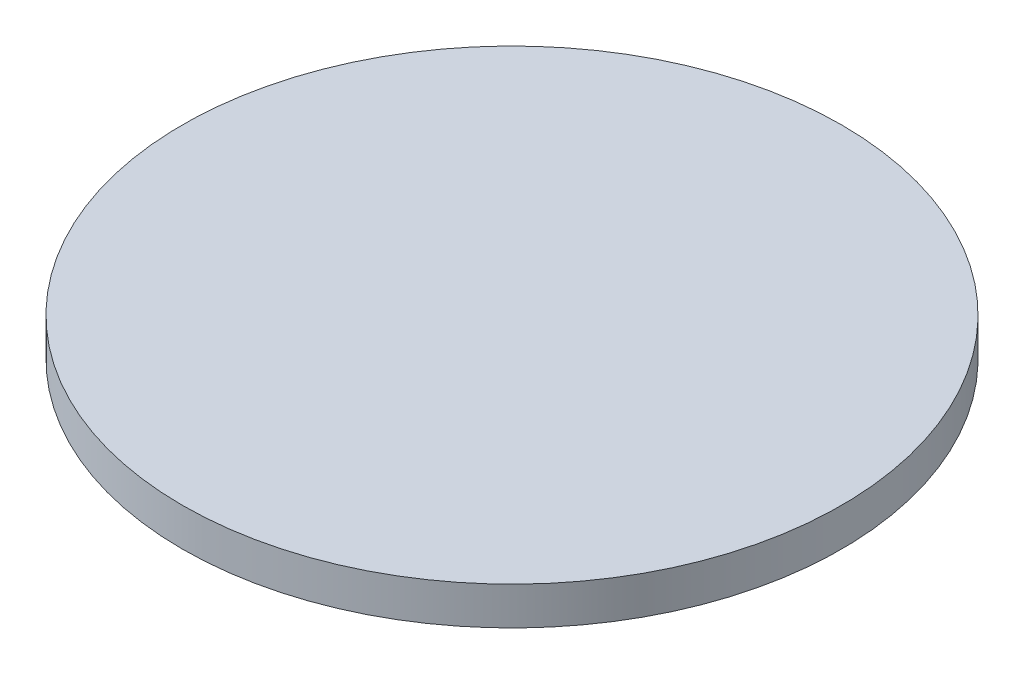
ISO-10303-21;
HEADER;
FILE_DESCRIPTION(('STEP AP214'),'2;1');
FILE_NAME('part.step','',(''),(''),'','','');
FILE_SCHEMA(('AUTOMOTIVE_DESIGN { 1 0 10303 214 1 1 1 1 }'));
ENDSEC;
DATA;
#1=APPLICATION_CONTEXT('core data for automotive mechanical design processes');
#2=APPLICATION_PROTOCOL_DEFINITION('international standard','automotive_design',2000,#1);
#3=PRODUCT_CONTEXT('',#1,'mechanical');
#4=PRODUCT('Part','Part','',(#3));
#5=PRODUCT_RELATED_PRODUCT_CATEGORY('part','',(#4));
#6=PRODUCT_DEFINITION_FORMATION('','',#4);
#7=PRODUCT_DEFINITION_CONTEXT('part definition',#1,'design');
#8=PRODUCT_DEFINITION('design','',#6,#7);
#9=PRODUCT_DEFINITION_SHAPE('','',#8);
#10=(LENGTH_UNIT() NAMED_UNIT(*) SI_UNIT(.MILLI.,.METRE.));
#11=(NAMED_UNIT(*) PLANE_ANGLE_UNIT() SI_UNIT($,.RADIAN.));
#12=(NAMED_UNIT(*) SI_UNIT($,.STERADIAN.) SOLID_ANGLE_UNIT());
#13=UNCERTAINTY_MEASURE_WITH_UNIT(LENGTH_MEASURE(1.E-05),#10,'distance_accuracy_value','');
#14=(GEOMETRIC_REPRESENTATION_CONTEXT(3) GLOBAL_UNCERTAINTY_ASSIGNED_CONTEXT((#13)) GLOBAL_UNIT_ASSIGNED_CONTEXT((#10,
#11,#12)) REPRESENTATION_CONTEXT('',''));
#15=CARTESIAN_POINT('',(0.,0.,0.));
#16=DIRECTION('',(0.,0.,1.));
#17=DIRECTION('',(1.,0.,0.));
#18=AXIS2_PLACEMENT_3D('',#15,#16,#17);
#19=CARTESIAN_POINT('',(0.,4.826,0.));
#20=DIRECTION('',(0.,-1.,0.));
#21=DIRECTION('',(0.,0.,-1.));
#22=AXIS2_PLACEMENT_3D('',#19,#20,#21);
#23=CYLINDRICAL_SURFACE('',#22,83.82);
#24=CARTESIAN_POINT('',(0.,4.826,0.));
#25=DIRECTION('',(0.,1.,0.));
#26=DIRECTION('',(0.,0.,1.));
#27=AXIS2_PLACEMENT_3D('',#24,#25,#26);
#28=CIRCLE('',#27,83.82);
#29=CARTESIAN_POINT('',(0.,4.826,83.82));
#30=VERTEX_POINT('',#29);
#31=EDGE_CURVE('E10',#30,#30,#28,.T.);
#32=ORIENTED_EDGE('',*,*,#31,.F.);
#33=EDGE_LOOP('',(#32));
#34=FACE_BOUND('',#33,.T.);
#35=CARTESIAN_POINT('',(0.,-4.826,0.));
#36=DIRECTION('',(0.,1.,0.));
#37=DIRECTION('',(0.,0.,1.));
#38=AXIS2_PLACEMENT_3D('',#35,#36,#37);
#39=CIRCLE('',#38,83.82);
#40=CARTESIAN_POINT('',(0.,-4.826,83.82));
#41=VERTEX_POINT('',#40);
#42=EDGE_CURVE('E35',#41,#41,#39,.T.);
#43=ORIENTED_EDGE('',*,*,#42,.T.);
#44=EDGE_LOOP('',(#43));
#45=FACE_BOUND('',#44,.T.);
#46=ADVANCED_FACE('F32',(#34,#45),#23,.T.);
#47=CARTESIAN_POINT('',(0.,4.826,0.));
#48=DIRECTION('',(0.,1.,0.));
#49=DIRECTION('',(0.,0.,1.));
#50=AXIS2_PLACEMENT_3D('',#47,#48,#49);
#51=PLANE('',#50);
#52=ORIENTED_EDGE('',*,*,#31,.T.);
#53=EDGE_LOOP('',(#52));
#54=FACE_BOUND('',#53,.T.);
#55=ADVANCED_FACE('F47',(#54),#51,.T.);
#56=CARTESIAN_POINT('',(0.,-4.826,0.));
#57=DIRECTION('',(0.,1.,0.));
#58=DIRECTION('',(0.,0.,1.));
#59=AXIS2_PLACEMENT_3D('',#56,#57,#58);
#60=PLANE('',#59);
#61=ORIENTED_EDGE('',*,*,#42,.F.);
#62=EDGE_LOOP('',(#61));
#63=FACE_BOUND('',#62,.T.);
#64=ADVANCED_FACE('F45',(#63),#60,.F.);
#65=CLOSED_SHELL('',(#46,#55,#64));
#66=MANIFOLD_SOLID_BREP('B2',#65);
#67=ADVANCED_BREP_SHAPE_REPRESENTATION('',(#18,#66),#14);
#68=SHAPE_DEFINITION_REPRESENTATION(#9,#67);
ENDSEC;
END-ISO-10303-21;
